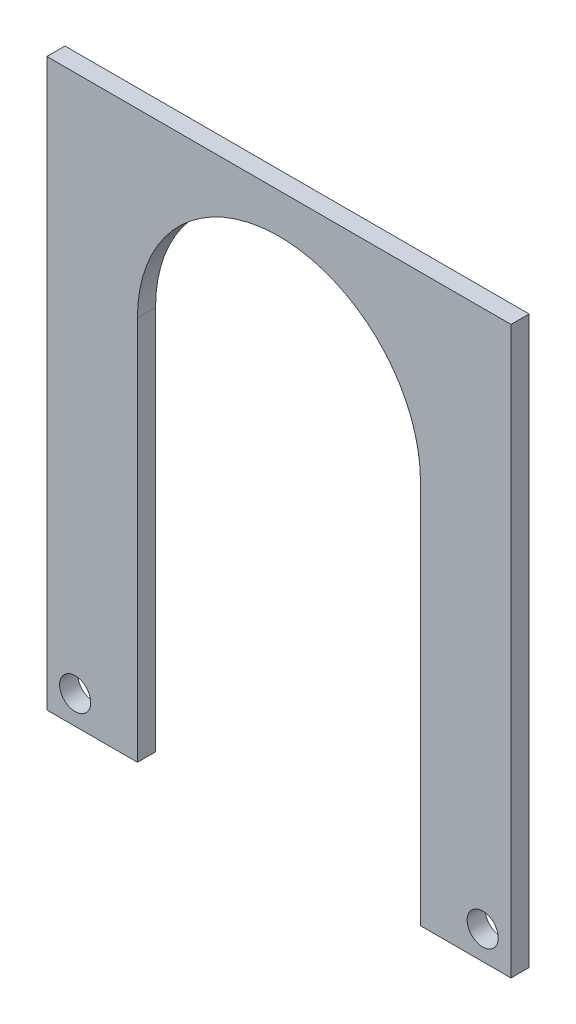
ISO-10303-21;
HEADER;
FILE_DESCRIPTION(('STEP AP214'),'2;1');
FILE_NAME('part.step','',(''),(''),'','','');
FILE_SCHEMA(('AUTOMOTIVE_DESIGN { 1 0 10303 214 1 1 1 1 }'));
ENDSEC;
DATA;
#1=APPLICATION_CONTEXT('core data for automotive mechanical design processes');
#2=APPLICATION_PROTOCOL_DEFINITION('international standard','automotive_design',2000,#1);
#3=PRODUCT_CONTEXT('',#1,'mechanical');
#4=PRODUCT('Part','Part','',(#3));
#5=PRODUCT_RELATED_PRODUCT_CATEGORY('part','',(#4));
#6=PRODUCT_DEFINITION_FORMATION('','',#4);
#7=PRODUCT_DEFINITION_CONTEXT('part definition',#1,'design');
#8=PRODUCT_DEFINITION('design','',#6,#7);
#9=PRODUCT_DEFINITION_SHAPE('','',#8);
#10=(LENGTH_UNIT() NAMED_UNIT(*) SI_UNIT(.MILLI.,.METRE.));
#11=(NAMED_UNIT(*) PLANE_ANGLE_UNIT() SI_UNIT($,.RADIAN.));
#12=(NAMED_UNIT(*) SI_UNIT($,.STERADIAN.) SOLID_ANGLE_UNIT());
#13=UNCERTAINTY_MEASURE_WITH_UNIT(LENGTH_MEASURE(1.E-05),#10,'distance_accuracy_value','');
#14=(GEOMETRIC_REPRESENTATION_CONTEXT(3) GLOBAL_UNCERTAINTY_ASSIGNED_CONTEXT((#13)) GLOBAL_UNIT_ASSIGNED_CONTEXT((#10,
#11,#12)) REPRESENTATION_CONTEXT('',''));
#15=CARTESIAN_POINT('',(0.,0.,0.));
#16=DIRECTION('',(0.,0.,1.));
#17=DIRECTION('',(1.,0.,0.));
#18=AXIS2_PLACEMENT_3D('',#15,#16,#17);
#19=CARTESIAN_POINT('',(-75.,-80.,3.2));
#20=DIRECTION('',(0.,1.,0.));
#21=DIRECTION('',(0.,0.,1.));
#22=AXIS2_PLACEMENT_3D('',#19,#20,#21);
#23=PLANE('',#22);
#24=DIRECTION('',(1.,0.,0.));
#25=VECTOR('',#24,1.);
#26=CARTESIAN_POINT('',(-75.,-80.,3.2));
#27=LINE('',#26,#25);
#28=CARTESIAN_POINT('',(-41.,-80.,3.2));
#29=VERTEX_POINT('',#28);
#30=CARTESIAN_POINT('',(-25.,-80.,3.2));
#31=VERTEX_POINT('',#30);
#32=EDGE_CURVE('E11',#29,#31,#27,.T.);
#33=ORIENTED_EDGE('',*,*,#32,.F.);
#34=DIRECTION('',(0.,0.,1.));
#35=VECTOR('',#34,1.);
#36=CARTESIAN_POINT('',(-41.,-80.,-0.00100000000000013));
#37=LINE('',#36,#35);
#38=CARTESIAN_POINT('',(-41.,-80.,0.));
#39=VERTEX_POINT('',#38);
#40=EDGE_CURVE('E98',#39,#29,#37,.T.);
#41=ORIENTED_EDGE('',*,*,#40,.F.);
#42=DIRECTION('',(1.,0.,0.));
#43=VECTOR('',#42,1.);
#44=CARTESIAN_POINT('',(-75.,-80.,0.));
#45=LINE('',#44,#43);
#46=CARTESIAN_POINT('',(-25.,-80.,0.));
#47=VERTEX_POINT('',#46);
#48=EDGE_CURVE('E37',#39,#47,#45,.T.);
#49=ORIENTED_EDGE('',*,*,#48,.T.);
#50=DIRECTION('',(0.,0.,1.));
#51=VECTOR('',#50,1.);
#52=CARTESIAN_POINT('',(-25.,-80.,-0.00100000000000013));
#53=LINE('',#52,#51);
#54=EDGE_CURVE('E122',#47,#31,#53,.T.);
#55=ORIENTED_EDGE('',*,*,#54,.T.);
#56=EDGE_LOOP('',(#33,#41,#49,#55));
#57=FACE_BOUND('',#56,.T.);
#58=ADVANCED_FACE('F33',(#57),#23,.F.);
#59=CARTESIAN_POINT('',(25.,-80.,0.));
#60=VERTEX_POINT('',#59);
#61=CARTESIAN_POINT('',(41.,-80.,0.));
#62=VERTEX_POINT('',#61);
#63=EDGE_CURVE('E129',#60,#62,#45,.T.);
#64=ORIENTED_EDGE('',*,*,#63,.T.);
#65=DIRECTION('',(0.,0.,1.));
#66=VECTOR('',#65,1.);
#67=CARTESIAN_POINT('',(41.,-80.,-0.00100000000000013));
#68=LINE('',#67,#66);
#69=CARTESIAN_POINT('',(41.,-80.,3.2));
#70=VERTEX_POINT('',#69);
#71=EDGE_CURVE('E151',#62,#70,#68,.T.);
#72=ORIENTED_EDGE('',*,*,#71,.T.);
#73=CARTESIAN_POINT('',(25.,-80.,3.2));
#74=VERTEX_POINT('',#73);
#75=EDGE_CURVE('E42',#74,#70,#27,.T.);
#76=ORIENTED_EDGE('',*,*,#75,.F.);
#77=DIRECTION('',(0.,0.,1.));
#78=VECTOR('',#77,1.);
#79=CARTESIAN_POINT('',(25.,-80.,-0.00100000000000013));
#80=LINE('',#79,#78);
#81=EDGE_CURVE('E138',#60,#74,#80,.T.);
#82=ORIENTED_EDGE('',*,*,#81,.F.);
#83=EDGE_LOOP('',(#64,#72,#76,#82));
#84=FACE_BOUND('',#83,.T.);
#85=ADVANCED_FACE('F35',(#84),#23,.F.);
#86=CARTESIAN_POINT('',(0.,0.,3.2));
#87=DIRECTION('',(0.,0.,1.));
#88=DIRECTION('',(1.,0.,0.));
#89=AXIS2_PLACEMENT_3D('',#86,#87,#88);
#90=PLANE('',#89);
#91=CARTESIAN_POINT('',(-36.,-75.,3.2));
#92=DIRECTION('',(0.,0.,1.));
#93=DIRECTION('',(1.,0.,0.));
#94=AXIS2_PLACEMENT_3D('',#91,#92,#93);
#95=CIRCLE('',#94,2.75);
#96=CARTESIAN_POINT('',(-33.25,-75.,3.2));
#97=VERTEX_POINT('',#96);
#98=EDGE_CURVE('E173',#97,#97,#95,.T.);
#99=ORIENTED_EDGE('',*,*,#98,.F.);
#100=EDGE_LOOP('',(#99));
#101=FACE_BOUND('',#100,.T.);
#102=CARTESIAN_POINT('',(36.,-75.,3.2));
#103=DIRECTION('',(0.,0.,1.));
#104=DIRECTION('',(1.,0.,0.));
#105=AXIS2_PLACEMENT_3D('',#102,#103,#104);
#106=CIRCLE('',#105,2.74999999999999);
#107=CARTESIAN_POINT('',(38.75,-75.,3.2));
#108=VERTEX_POINT('',#107);
#109=EDGE_CURVE('E167',#108,#108,#106,.T.);
#110=ORIENTED_EDGE('',*,*,#109,.F.);
#111=EDGE_LOOP('',(#110));
#112=FACE_BOUND('',#111,.T.);
#113=DIRECTION('',(0.,-1.,0.));
#114=VECTOR('',#113,1.);
#115=CARTESIAN_POINT('',(41.,-80.,3.2));
#116=LINE('',#115,#114);
#117=CARTESIAN_POINT('',(41.,20.,3.2));
#118=VERTEX_POINT('',#117);
#119=EDGE_CURVE('E109',#118,#70,#116,.T.);
#120=ORIENTED_EDGE('',*,*,#119,.F.);
#121=DIRECTION('',(1.,0.,0.));
#122=VECTOR('',#121,1.);
#123=CARTESIAN_POINT('',(-41.,20.,3.2));
#124=LINE('',#123,#122);
#125=CARTESIAN_POINT('',(-41.,20.,3.2));
#126=VERTEX_POINT('',#125);
#127=EDGE_CURVE('E117',#126,#118,#124,.T.);
#128=ORIENTED_EDGE('',*,*,#127,.F.);
#129=DIRECTION('',(0.,1.,0.));
#130=VECTOR('',#129,1.);
#131=CARTESIAN_POINT('',(-41.,20.,3.2));
#132=LINE('',#131,#130);
#133=EDGE_CURVE('E101',#29,#126,#132,.T.);
#134=ORIENTED_EDGE('',*,*,#133,.F.);
#135=ORIENTED_EDGE('',*,*,#32,.T.);
#136=DIRECTION('',(0.,-1.,0.));
#137=VECTOR('',#136,1.);
#138=CARTESIAN_POINT('',(-25.,-12.,3.2));
#139=LINE('',#138,#137);
#140=CARTESIAN_POINT('',(-25.,-12.,3.2));
#141=VERTEX_POINT('',#140);
#142=EDGE_CURVE('E134',#141,#31,#139,.T.);
#143=ORIENTED_EDGE('',*,*,#142,.F.);
#144=CARTESIAN_POINT('',(0.,-12.,3.2));
#145=DIRECTION('',(0.,0.,1.));
#146=DIRECTION('',(-1.,0.,0.));
#147=AXIS2_PLACEMENT_3D('',#144,#145,#146);
#148=CIRCLE('',#147,25.);
#149=CARTESIAN_POINT('',(25.,-12.,3.2));
#150=VERTEX_POINT('',#149);
#151=EDGE_CURVE('E143',#150,#141,#148,.T.);
#152=ORIENTED_EDGE('',*,*,#151,.F.);
#153=DIRECTION('',(0.,1.,0.));
#154=VECTOR('',#153,1.);
#155=CARTESIAN_POINT('',(25.,-12.,3.2));
#156=LINE('',#155,#154);
#157=EDGE_CURVE('E145',#74,#150,#156,.T.);
#158=ORIENTED_EDGE('',*,*,#157,.F.);
#159=ORIENTED_EDGE('',*,*,#75,.T.);
#160=EDGE_LOOP('',(#120,#128,#134,#135,#143,#152,#158,#159));
#161=FACE_BOUND('',#160,.T.);
#162=ADVANCED_FACE('F113',(#101,#112,#161),#90,.T.);
#163=CARTESIAN_POINT('',(0.,0.,0.));
#164=DIRECTION('',(0.,0.,1.));
#165=DIRECTION('',(1.,0.,0.));
#166=AXIS2_PLACEMENT_3D('',#163,#164,#165);
#167=PLANE('',#166);
#168=CARTESIAN_POINT('',(-36.,-75.,0.));
#169=DIRECTION('',(0.,0.,1.));
#170=DIRECTION('',(1.,0.,0.));
#171=AXIS2_PLACEMENT_3D('',#168,#169,#170);
#172=CIRCLE('',#171,2.75);
#173=CARTESIAN_POINT('',(-33.25,-75.,0.));
#174=VERTEX_POINT('',#173);
#175=EDGE_CURVE('E170',#174,#174,#172,.F.);
#176=ORIENTED_EDGE('',*,*,#175,.F.);
#177=EDGE_LOOP('',(#176));
#178=FACE_BOUND('',#177,.T.);
#179=CARTESIAN_POINT('',(36.,-75.,0.));
#180=DIRECTION('',(0.,0.,1.));
#181=DIRECTION('',(1.,0.,0.));
#182=AXIS2_PLACEMENT_3D('',#179,#180,#181);
#183=CIRCLE('',#182,2.74999999999999);
#184=CARTESIAN_POINT('',(38.75,-75.,0.));
#185=VERTEX_POINT('',#184);
#186=EDGE_CURVE('E164',#185,#185,#183,.F.);
#187=ORIENTED_EDGE('',*,*,#186,.F.);
#188=EDGE_LOOP('',(#187));
#189=FACE_BOUND('',#188,.T.);
#190=DIRECTION('',(-1.,0.,0.));
#191=VECTOR('',#190,1.);
#192=CARTESIAN_POINT('',(-41.,20.,0.));
#193=LINE('',#192,#191);
#194=CARTESIAN_POINT('',(41.,20.,0.));
#195=VERTEX_POINT('',#194);
#196=CARTESIAN_POINT('',(-41.,20.,0.));
#197=VERTEX_POINT('',#196);
#198=EDGE_CURVE('E49',#195,#197,#193,.T.);
#199=ORIENTED_EDGE('',*,*,#198,.F.);
#200=DIRECTION('',(0.,1.,0.));
#201=VECTOR('',#200,1.);
#202=CARTESIAN_POINT('',(41.,-80.,0.));
#203=LINE('',#202,#201);
#204=EDGE_CURVE('E118',#62,#195,#203,.T.);
#205=ORIENTED_EDGE('',*,*,#204,.F.);
#206=ORIENTED_EDGE('',*,*,#63,.F.);
#207=DIRECTION('',(0.,-1.,0.));
#208=VECTOR('',#207,1.);
#209=CARTESIAN_POINT('',(25.,-12.,0.));
#210=LINE('',#209,#208);
#211=CARTESIAN_POINT('',(25.,-12.,0.));
#212=VERTEX_POINT('',#211);
#213=EDGE_CURVE('E126',#212,#60,#210,.T.);
#214=ORIENTED_EDGE('',*,*,#213,.F.);
#215=CARTESIAN_POINT('',(0.,-12.,0.));
#216=DIRECTION('',(0.,0.,1.));
#217=DIRECTION('',(1.,0.,0.));
#218=AXIS2_PLACEMENT_3D('',#215,#216,#217);
#219=CIRCLE('',#218,25.);
#220=CARTESIAN_POINT('',(-25.,-12.,0.));
#221=VERTEX_POINT('',#220);
#222=EDGE_CURVE('E57',#221,#212,#219,.F.);
#223=ORIENTED_EDGE('',*,*,#222,.F.);
#224=DIRECTION('',(0.,1.,0.));
#225=VECTOR('',#224,1.);
#226=CARTESIAN_POINT('',(-25.,-12.,0.));
#227=LINE('',#226,#225);
#228=EDGE_CURVE('E147',#47,#221,#227,.T.);
#229=ORIENTED_EDGE('',*,*,#228,.F.);
#230=ORIENTED_EDGE('',*,*,#48,.F.);
#231=DIRECTION('',(0.,-1.,0.));
#232=VECTOR('',#231,1.);
#233=CARTESIAN_POINT('',(-41.,20.,0.));
#234=LINE('',#233,#232);
#235=EDGE_CURVE('E104',#197,#39,#234,.T.);
#236=ORIENTED_EDGE('',*,*,#235,.F.);
#237=EDGE_LOOP('',(#199,#205,#206,#214,#223,#229,#230,#236));
#238=FACE_BOUND('',#237,.T.);
#239=ADVANCED_FACE('F182',(#178,#189,#238),#167,.F.);
#240=CARTESIAN_POINT('',(-25.,-12.,-0.00100000000000013));
#241=DIRECTION('',(-1.,0.,0.));
#242=DIRECTION('',(0.,-1.,0.));
#243=AXIS2_PLACEMENT_3D('',#240,#241,#242);
#244=PLANE('',#243);
#245=ORIENTED_EDGE('',*,*,#228,.T.);
#246=DIRECTION('',(0.,0.,1.));
#247=VECTOR('',#246,1.);
#248=CARTESIAN_POINT('',(-25.,-12.,-0.00100000000000013));
#249=LINE('',#248,#247);
#250=EDGE_CURVE('E127',#221,#141,#249,.T.);
#251=ORIENTED_EDGE('',*,*,#250,.T.);
#252=ORIENTED_EDGE('',*,*,#142,.T.);
#253=ORIENTED_EDGE('',*,*,#54,.F.);
#254=EDGE_LOOP('',(#245,#251,#252,#253));
#255=FACE_BOUND('',#254,.T.);
#256=ADVANCED_FACE('F194',(#255),#244,.F.);
#257=CARTESIAN_POINT('',(0.,-12.,-0.00100000000000013));
#258=DIRECTION('',(0.,0.,1.));
#259=DIRECTION('',(1.,0.,0.));
#260=AXIS2_PLACEMENT_3D('',#257,#258,#259);
#261=CYLINDRICAL_SURFACE('',#260,25.);
#262=ORIENTED_EDGE('',*,*,#222,.T.);
#263=DIRECTION('',(0.,0.,1.));
#264=VECTOR('',#263,1.);
#265=CARTESIAN_POINT('',(25.,-12.,-0.00100000000000013));
#266=LINE('',#265,#264);
#267=EDGE_CURVE('E131',#212,#150,#266,.T.);
#268=ORIENTED_EDGE('',*,*,#267,.T.);
#269=ORIENTED_EDGE('',*,*,#151,.T.);
#270=ORIENTED_EDGE('',*,*,#250,.F.);
#271=EDGE_LOOP('',(#262,#268,#269,#270));
#272=FACE_BOUND('',#271,.T.);
#273=ADVANCED_FACE('F204',(#272),#261,.F.);
#274=CARTESIAN_POINT('',(25.,-12.,-0.00100000000000013));
#275=DIRECTION('',(1.,0.,0.));
#276=DIRECTION('',(0.,0.,-1.));
#277=AXIS2_PLACEMENT_3D('',#274,#275,#276);
#278=PLANE('',#277);
#279=ORIENTED_EDGE('',*,*,#213,.T.);
#280=ORIENTED_EDGE('',*,*,#81,.T.);
#281=ORIENTED_EDGE('',*,*,#157,.T.);
#282=ORIENTED_EDGE('',*,*,#267,.F.);
#283=EDGE_LOOP('',(#279,#280,#281,#282));
#284=FACE_BOUND('',#283,.T.);
#285=ADVANCED_FACE('F203',(#284),#278,.F.);
#286=CARTESIAN_POINT('',(41.,-80.,-0.00100000000000013));
#287=DIRECTION('',(-1.,0.,0.));
#288=DIRECTION('',(0.,-1.,0.));
#289=AXIS2_PLACEMENT_3D('',#286,#287,#288);
#290=PLANE('',#289);
#291=ORIENTED_EDGE('',*,*,#204,.T.);
#292=DIRECTION('',(0.,0.,1.));
#293=VECTOR('',#292,1.);
#294=CARTESIAN_POINT('',(41.,20.,-0.00100000000000013));
#295=LINE('',#294,#293);
#296=EDGE_CURVE('E154',#195,#118,#295,.T.);
#297=ORIENTED_EDGE('',*,*,#296,.T.);
#298=ORIENTED_EDGE('',*,*,#119,.T.);
#299=ORIENTED_EDGE('',*,*,#71,.F.);
#300=EDGE_LOOP('',(#291,#297,#298,#299));
#301=FACE_BOUND('',#300,.T.);
#302=ADVANCED_FACE('F211',(#301),#290,.F.);
#303=CARTESIAN_POINT('',(-41.,20.,-0.00100000000000013));
#304=DIRECTION('',(0.,-1.,0.));
#305=DIRECTION('',(0.,0.,-1.));
#306=AXIS2_PLACEMENT_3D('',#303,#304,#305);
#307=PLANE('',#306);
#308=ORIENTED_EDGE('',*,*,#198,.T.);
#309=DIRECTION('',(0.,0.,1.));
#310=VECTOR('',#309,1.);
#311=CARTESIAN_POINT('',(-41.,20.,-0.00100000000000013));
#312=LINE('',#311,#310);
#313=EDGE_CURVE('E108',#197,#126,#312,.T.);
#314=ORIENTED_EDGE('',*,*,#313,.T.);
#315=ORIENTED_EDGE('',*,*,#127,.T.);
#316=ORIENTED_EDGE('',*,*,#296,.F.);
#317=EDGE_LOOP('',(#308,#314,#315,#316));
#318=FACE_BOUND('',#317,.T.);
#319=ADVANCED_FACE('F261',(#318),#307,.F.);
#320=CARTESIAN_POINT('',(-41.,20.,-0.00100000000000013));
#321=DIRECTION('',(1.,0.,0.));
#322=DIRECTION('',(0.,1.,0.));
#323=AXIS2_PLACEMENT_3D('',#320,#321,#322);
#324=PLANE('',#323);
#325=ORIENTED_EDGE('',*,*,#235,.T.);
#326=ORIENTED_EDGE('',*,*,#40,.T.);
#327=ORIENTED_EDGE('',*,*,#133,.T.);
#328=ORIENTED_EDGE('',*,*,#313,.F.);
#329=EDGE_LOOP('',(#325,#326,#327,#328));
#330=FACE_BOUND('',#329,.T.);
#331=ADVANCED_FACE('F100',(#330),#324,.F.);
#332=CARTESIAN_POINT('',(36.,-75.,-0.00100000000000013));
#333=DIRECTION('',(0.,0.,1.));
#334=DIRECTION('',(1.,0.,0.));
#335=AXIS2_PLACEMENT_3D('',#332,#333,#334);
#336=CYLINDRICAL_SURFACE('',#335,2.74999999999999);
#337=ORIENTED_EDGE('',*,*,#109,.T.);
#338=EDGE_LOOP('',(#337));
#339=FACE_BOUND('',#338,.T.);
#340=ORIENTED_EDGE('',*,*,#186,.T.);
#341=EDGE_LOOP('',(#340));
#342=FACE_BOUND('',#341,.T.);
#343=ADVANCED_FACE('F186',(#339,#342),#336,.F.);
#344=CARTESIAN_POINT('',(-36.,-75.,-0.00100000000000013));
#345=DIRECTION('',(0.,0.,1.));
#346=DIRECTION('',(1.,0.,0.));
#347=AXIS2_PLACEMENT_3D('',#344,#345,#346);
#348=CYLINDRICAL_SURFACE('',#347,2.75);
#349=ORIENTED_EDGE('',*,*,#98,.T.);
#350=EDGE_LOOP('',(#349));
#351=FACE_BOUND('',#350,.T.);
#352=ORIENTED_EDGE('',*,*,#175,.T.);
#353=EDGE_LOOP('',(#352));
#354=FACE_BOUND('',#353,.T.);
#355=ADVANCED_FACE('F177',(#351,#354),#348,.F.);
#356=CLOSED_SHELL('',(#58,#85,#162,#239,#256,#273,#285,#302,#319,#331,#343,#355));
#357=MANIFOLD_SOLID_BREP('B2',#356);
#358=ADVANCED_BREP_SHAPE_REPRESENTATION('',(#18,#357),#14);
#359=SHAPE_DEFINITION_REPRESENTATION(#9,#358);
ENDSEC;
END-ISO-10303-21;
